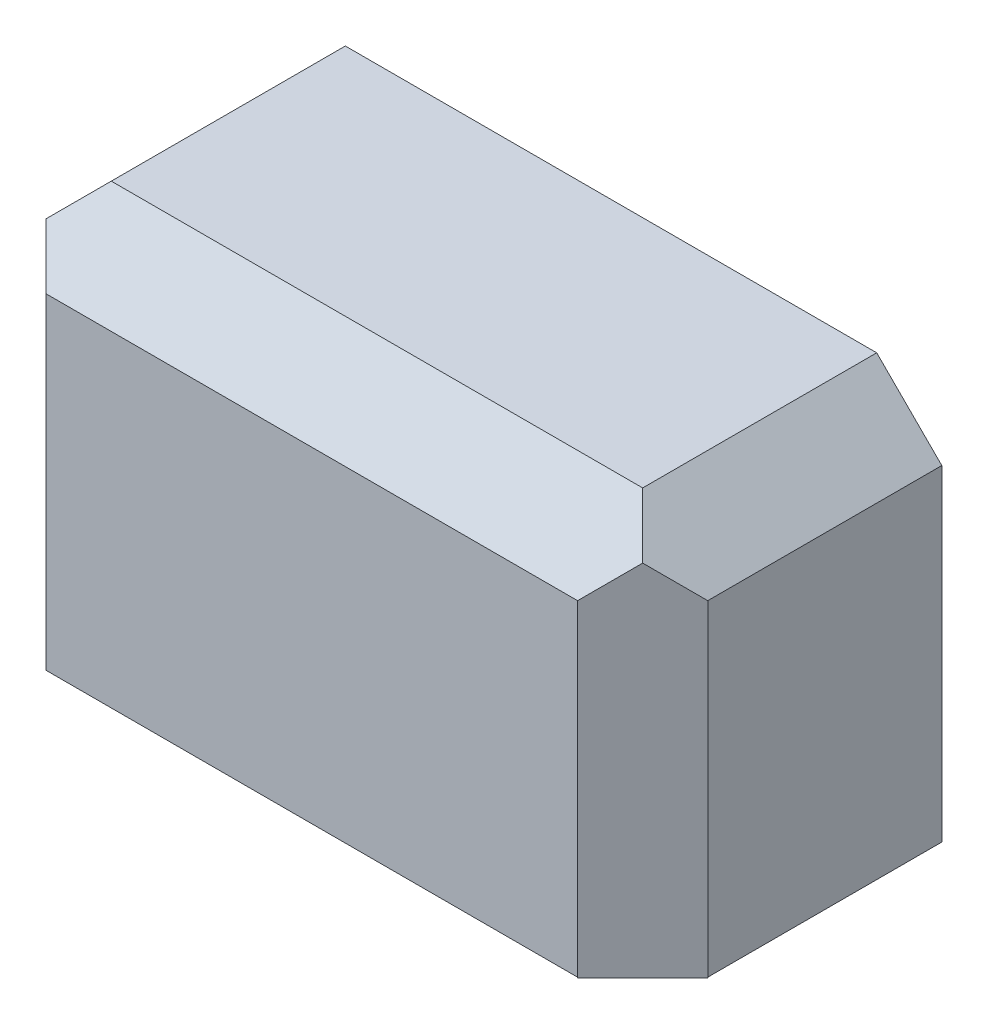
ISO-10303-21;
HEADER;
FILE_DESCRIPTION(('STEP AP214'),'2;1');
FILE_NAME('part.step','',(''),(''),'','','');
FILE_SCHEMA(('AUTOMOTIVE_DESIGN { 1 0 10303 214 1 1 1 1 }'));
ENDSEC;
DATA;
#1=APPLICATION_CONTEXT('core data for automotive mechanical design processes');
#2=APPLICATION_PROTOCOL_DEFINITION('international standard','automotive_design',2000,#1);
#3=PRODUCT_CONTEXT('',#1,'mechanical');
#4=PRODUCT('Part','Part','',(#3));
#5=PRODUCT_RELATED_PRODUCT_CATEGORY('part','',(#4));
#6=PRODUCT_DEFINITION_FORMATION('','',#4);
#7=PRODUCT_DEFINITION_CONTEXT('part definition',#1,'design');
#8=PRODUCT_DEFINITION('design','',#6,#7);
#9=PRODUCT_DEFINITION_SHAPE('','',#8);
#10=(LENGTH_UNIT() NAMED_UNIT(*) SI_UNIT(.MILLI.,.METRE.));
#11=(NAMED_UNIT(*) PLANE_ANGLE_UNIT() SI_UNIT($,.RADIAN.));
#12=(NAMED_UNIT(*) SI_UNIT($,.STERADIAN.) SOLID_ANGLE_UNIT());
#13=UNCERTAINTY_MEASURE_WITH_UNIT(LENGTH_MEASURE(1.E-05),#10,'distance_accuracy_value','');
#14=(GEOMETRIC_REPRESENTATION_CONTEXT(3) GLOBAL_UNCERTAINTY_ASSIGNED_CONTEXT((#13)) GLOBAL_UNIT_ASSIGNED_CONTEXT((#10,
#11,#12)) REPRESENTATION_CONTEXT('',''));
#15=CARTESIAN_POINT('',(0.,0.,0.));
#16=DIRECTION('',(0.,0.,1.));
#17=DIRECTION('',(1.,0.,0.));
#18=AXIS2_PLACEMENT_3D('',#15,#16,#17);
#19=CARTESIAN_POINT('',(365.125,0.,165.1));
#20=DIRECTION('',(0.,1.,0.));
#21=DIRECTION('',(-1.,0.,0.));
#22=AXIS2_PLACEMENT_3D('',#19,#20,#21);
#23=PLANE('',#22);
#24=DIRECTION('',(-0.707106781186545,0.,-0.70710678118655));
#25=VECTOR('',#24,1.);
#26=CARTESIAN_POINT('',(383.085512242138,0.,147.139487757862));
#27=LINE('',#26,#25);
#28=CARTESIAN_POINT('',(365.125,0.,129.178975515723));
#29=VERTEX_POINT('',#28);
#30=CARTESIAN_POINT('',(361.757403954599,0.,125.811379470323));
#31=VERTEX_POINT('',#30);
#32=EDGE_CURVE('E47',#29,#31,#27,.T.);
#33=ORIENTED_EDGE('',*,*,#32,.T.);
#34=DIRECTION('',(-0.707106781186548,0.,0.707106781186547));
#35=VECTOR('',#34,1.);
#36=CARTESIAN_POINT('',(343.796891712461,0.,143.771891712461));
#37=LINE('',#36,#35);
#38=CARTESIAN_POINT('',(360.3625,0.,127.206283424922));
#39=VERTEX_POINT('',#38);
#40=EDGE_CURVE('E362',#31,#39,#37,.T.);
#41=ORIENTED_EDGE('',*,*,#40,.T.);
#42=DIRECTION('',(0.,0.,1.));
#43=VECTOR('',#42,1.);
#44=CARTESIAN_POINT('',(360.3625,0.,4.7625));
#45=LINE('',#44,#43);
#46=CARTESIAN_POINT('',(360.3625,0.,4.7625));
#47=VERTEX_POINT('',#46);
#48=EDGE_CURVE('E247',#47,#39,#45,.T.);
#49=ORIENTED_EDGE('',*,*,#48,.F.);
#50=DIRECTION('',(1.,0.,0.));
#51=VECTOR('',#50,1.);
#52=CARTESIAN_POINT('',(4.7625,0.,4.7625));
#53=LINE('',#52,#51);
#54=CARTESIAN_POINT('',(4.7625,0.,4.7625));
#55=VERTEX_POINT('',#54);
#56=EDGE_CURVE('E223',#55,#47,#53,.T.);
#57=ORIENTED_EDGE('',*,*,#56,.F.);
#58=DIRECTION('',(0.,0.,1.));
#59=VECTOR('',#58,1.);
#60=CARTESIAN_POINT('',(4.7625,0.,4.7625));
#61=LINE('',#60,#59);
#62=CARTESIAN_POINT('',(4.7625,0.,127.206283424922));
#63=VERTEX_POINT('',#62);
#64=EDGE_CURVE('E248',#55,#63,#61,.T.);
#65=ORIENTED_EDGE('',*,*,#64,.T.);
#66=DIRECTION('',(0.707106781186549,0.,0.707106781186546));
#67=VECTOR('',#66,1.);
#68=CARTESIAN_POINT('',(203.89060828754,0.,326.334391712461));
#69=LINE('',#68,#67);
#70=CARTESIAN_POINT('',(3.36759604540092,0.,125.811379470323));
#71=VERTEX_POINT('',#70);
#72=EDGE_CURVE('E324',#71,#63,#69,.T.);
#73=ORIENTED_EDGE('',*,*,#72,.F.);
#74=DIRECTION('',(0.707106781186546,0.,-0.707106781186549));
#75=VECTOR('',#74,1.);
#76=CARTESIAN_POINT('',(164.601987757861,0.,-35.4230122421382));
#77=LINE('',#76,#75);
#78=CARTESIAN_POINT('',(0.,0.,129.178975515723));
#79=VERTEX_POINT('',#78);
#80=EDGE_CURVE('E334',#79,#71,#77,.T.);
#81=ORIENTED_EDGE('',*,*,#80,.F.);
#82=DIRECTION('',(0.,0.,-1.));
#83=VECTOR('',#82,1.);
#84=CARTESIAN_POINT('',(0.,0.,165.1));
#85=LINE('',#84,#83);
#86=CARTESIAN_POINT('',(0.,0.,0.));
#87=VERTEX_POINT('',#86);
#88=EDGE_CURVE('E267',#79,#87,#85,.T.);
#89=ORIENTED_EDGE('',*,*,#88,.T.);
#90=DIRECTION('',(1.,0.,0.));
#91=VECTOR('',#90,1.);
#92=CARTESIAN_POINT('',(365.125,0.,0.));
#93=LINE('',#92,#91);
#94=CARTESIAN_POINT('',(365.125,0.,0.));
#95=VERTEX_POINT('',#94);
#96=EDGE_CURVE('E251',#87,#95,#93,.T.);
#97=ORIENTED_EDGE('',*,*,#96,.T.);
#98=DIRECTION('',(0.,0.,-1.));
#99=VECTOR('',#98,1.);
#100=CARTESIAN_POINT('',(365.125,0.,165.1));
#101=LINE('',#100,#99);
#102=EDGE_CURVE('E294',#29,#95,#101,.T.);
#103=ORIENTED_EDGE('',*,*,#102,.F.);
#104=EDGE_LOOP('',(#33,#41,#49,#57,#65,#73,#81,#89,#97,#103));
#105=FACE_BOUND('',#104,.T.);
#106=ADVANCED_FACE('F32',(#105),#23,.F.);
#107=CARTESIAN_POINT('',(0.,179.978975515723,165.1));
#108=DIRECTION('',(0.707106781186547,-0.707106781186548,0.));
#109=DIRECTION('',(0.707106781186548,0.707106781186547,0.));
#110=AXIS2_PLACEMENT_3D('',#107,#108,#109);
#111=PLANE('',#110);
#112=DIRECTION('',(0.,0.,-1.));
#113=VECTOR('',#112,1.);
#114=CARTESIAN_POINT('',(0.,179.978975515723,165.1));
#115=LINE('',#114,#113);
#116=CARTESIAN_POINT('',(0.,179.978975515723,129.178975515724));
#117=VERTEX_POINT('',#116);
#118=CARTESIAN_POINT('',(0.,179.978975515723,0.));
#119=VERTEX_POINT('',#118);
#120=EDGE_CURVE('E286',#117,#119,#115,.T.);
#121=ORIENTED_EDGE('',*,*,#120,.F.);
#122=DIRECTION('',(-0.577350269189627,-0.577350269189626,-0.577350269189625));
#123=VECTOR('',#122,1.);
#124=CARTESIAN_POINT('',(-109.734658505241,70.2443170104821,19.4443170104825));
#125=LINE('',#124,#123);
#126=CARTESIAN_POINT('',(17.9605122421383,197.939487757862,147.139487757862));
#127=VERTEX_POINT('',#126);
#128=EDGE_CURVE('E213',#127,#117,#125,.T.);
#129=ORIENTED_EDGE('',*,*,#128,.F.);
#130=DIRECTION('',(0.577350269189627,0.577350269189626,-0.577350269189624));
#131=VECTOR('',#130,1.);
#132=CARTESIAN_POINT('',(125.433666666667,305.41264218239,39.6663333333334));
#133=LINE('',#132,#131);
#134=CARTESIAN_POINT('',(35.9210244842766,215.9,129.178975515723));
#135=VERTEX_POINT('',#134);
#136=EDGE_CURVE('E319',#127,#135,#133,.T.);
#137=ORIENTED_EDGE('',*,*,#136,.T.);
#138=DIRECTION('',(0.,0.,-1.));
#139=VECTOR('',#138,1.);
#140=CARTESIAN_POINT('',(35.9210244842766,215.9,165.1));
#141=LINE('',#140,#139);
#142=CARTESIAN_POINT('',(35.9210244842766,215.9,0.));
#143=VERTEX_POINT('',#142);
#144=EDGE_CURVE('E288',#135,#143,#141,.T.);
#145=ORIENTED_EDGE('',*,*,#144,.T.);
#146=DIRECTION('',(-0.707106781186548,-0.707106781186547,0.));
#147=VECTOR('',#146,1.);
#148=CARTESIAN_POINT('',(0.,179.978975515723,0.));
#149=LINE('',#148,#147);
#150=EDGE_CURVE('E280',#143,#119,#149,.T.);
#151=ORIENTED_EDGE('',*,*,#150,.T.);
#152=EDGE_LOOP('',(#121,#129,#137,#145,#151));
#153=FACE_BOUND('',#152,.T.);
#154=ADVANCED_FACE('F433',(#153),#111,.F.);
#155=CARTESIAN_POINT('',(4.7625,177.794773237157,4.7625));
#156=DIRECTION('',(-0.707106781186548,0.707106781186548,0.));
#157=DIRECTION('',(-0.707106781186548,-0.707106781186548,0.));
#158=AXIS2_PLACEMENT_3D('',#155,#156,#157);
#159=PLANE('',#158);
#160=DIRECTION('',(0.577350269189627,0.577350269189627,0.577350269189624));
#161=VECTOR('',#160,1.);
#162=CARTESIAN_POINT('',(-36.0520944749738,136.980178762183,86.3916889499479));
#163=LINE('',#162,#161);
#164=CARTESIAN_POINT('',(4.7625,177.794773237157,127.206283424922));
#165=VERTEX_POINT('',#164);
#166=CARTESIAN_POINT('',(21.4338633814217,194.466136618578,143.877646806343));
#167=VERTEX_POINT('',#166);
#168=EDGE_CURVE('E309',#165,#167,#163,.T.);
#169=ORIENTED_EDGE('',*,*,#168,.F.);
#170=DIRECTION('',(0.,0.,1.));
#171=VECTOR('',#170,1.);
#172=CARTESIAN_POINT('',(4.7625,177.794773237157,4.7625));
#173=LINE('',#172,#171);
#174=CARTESIAN_POINT('',(4.7625,177.794773237157,4.7625));
#175=VERTEX_POINT('',#174);
#176=EDGE_CURVE('E252',#175,#165,#173,.T.);
#177=ORIENTED_EDGE('',*,*,#176,.F.);
#178=DIRECTION('',(-0.707106781186547,-0.707106781186547,0.));
#179=VECTOR('',#178,1.);
#180=CARTESIAN_POINT('',(4.7625,177.794773237157,4.7625));
#181=LINE('',#180,#179);
#182=CARTESIAN_POINT('',(38.1052267628434,211.1375,4.7625));
#183=VERTEX_POINT('',#182);
#184=EDGE_CURVE('E241',#183,#175,#181,.T.);
#185=ORIENTED_EDGE('',*,*,#184,.F.);
#186=DIRECTION('',(0.,0.,1.));
#187=VECTOR('',#186,1.);
#188=CARTESIAN_POINT('',(38.1052267628434,211.1375,4.7625));
#189=LINE('',#188,#187);
#190=CARTESIAN_POINT('',(38.1052267628434,211.1375,127.206283424922));
#191=VERTEX_POINT('',#190);
#192=EDGE_CURVE('E255',#183,#191,#189,.T.);
#193=ORIENTED_EDGE('',*,*,#192,.T.);
#194=DIRECTION('',(-0.577350269189626,-0.577350269189626,0.577350269189625));
#195=VECTOR('',#194,1.);
#196=CARTESIAN_POINT('',(56.6913367292549,229.723609966411,108.62017345851));
#197=LINE('',#196,#195);
#198=EDGE_CURVE('E226',#191,#167,#197,.T.);
#199=ORIENTED_EDGE('',*,*,#198,.T.);
#200=EDGE_LOOP('',(#169,#177,#185,#193,#199));
#201=FACE_BOUND('',#200,.T.);
#202=ADVANCED_FACE('F308',(#201),#159,.F.);
#203=CARTESIAN_POINT('',(0.,0.,160.3375));
#204=DIRECTION('',(0.,0.,-1.));
#205=DIRECTION('',(-1.,0.,0.));
#206=AXIS2_PLACEMENT_3D('',#203,#204,#205);
#207=PLANE('',#206);
#208=DIRECTION('',(0.,1.,0.));
#209=VECTOR('',#208,1.);
#210=CARTESIAN_POINT('',(327.231283424922,0.,160.3375));
#211=LINE('',#210,#209);
#212=CARTESIAN_POINT('',(327.231283424922,0.,160.3375));
#213=VERTEX_POINT('',#212);
#214=CARTESIAN_POINT('',(327.231283424921,178.006283424921,160.3375));
#215=VERTEX_POINT('',#214);
#216=EDGE_CURVE('E364',#213,#215,#211,.T.);
#217=ORIENTED_EDGE('',*,*,#216,.F.);
#218=DIRECTION('',(1.,0.,0.));
#219=VECTOR('',#218,1.);
#220=CARTESIAN_POINT('',(365.125,0.,160.3375));
#221=LINE('',#220,#219);
#222=CARTESIAN_POINT('',(37.8937165750785,0.,160.3375));
#223=VERTEX_POINT('',#222);
#224=EDGE_CURVE('E220',#223,#213,#221,.T.);
#225=ORIENTED_EDGE('',*,*,#224,.F.);
#226=DIRECTION('',(0.,1.,0.));
#227=VECTOR('',#226,1.);
#228=CARTESIAN_POINT('',(37.8937165750785,0.,160.3375));
#229=LINE('',#228,#227);
#230=CARTESIAN_POINT('',(37.8937165750785,178.006283424921,160.3375));
#231=VERTEX_POINT('',#230);
#232=EDGE_CURVE('E332',#223,#231,#229,.T.);
#233=ORIENTED_EDGE('',*,*,#232,.T.);
#234=DIRECTION('',(-1.,0.,0.));
#235=VECTOR('',#234,1.);
#236=CARTESIAN_POINT('',(0.,178.006283424921,160.3375));
#237=LINE('',#236,#235);
#238=EDGE_CURVE('E303',#215,#231,#237,.T.);
#239=ORIENTED_EDGE('',*,*,#238,.F.);
#240=EDGE_LOOP('',(#217,#225,#233,#239));
#241=FACE_BOUND('',#240,.T.);
#242=ADVANCED_FACE('F450',(#241),#207,.T.);
#243=DIRECTION('',(-0.707106781186548,0.,0.707106781186547));
#244=VECTOR('',#243,1.);
#245=CARTESIAN_POINT('',(343.796891712461,0.,143.771891712461));
#246=LINE('',#245,#244);
#247=CARTESIAN_POINT('',(325.836379470322,0.,161.732403954599));
#248=VERTEX_POINT('',#247);
#249=EDGE_CURVE('E55',#213,#248,#246,.T.);
#250=ORIENTED_EDGE('',*,*,#249,.T.);
#251=DIRECTION('',(0.707106781186545,0.,0.70710678118655));
#252=VECTOR('',#251,1.);
#253=CARTESIAN_POINT('',(347.164487757862,0.,183.060512242138));
#254=LINE('',#253,#252);
#255=CARTESIAN_POINT('',(329.203975515723,0.,165.1));
#256=VERTEX_POINT('',#255);
#257=EDGE_CURVE('E372',#248,#256,#254,.T.);
#258=ORIENTED_EDGE('',*,*,#257,.T.);
#259=DIRECTION('',(1.,0.,0.));
#260=VECTOR('',#259,1.);
#261=CARTESIAN_POINT('',(365.125,0.,165.1));
#262=LINE('',#261,#260);
#263=CARTESIAN_POINT('',(35.9210244842766,0.,165.1));
#264=VERTEX_POINT('',#263);
#265=EDGE_CURVE('E211',#264,#256,#262,.T.);
#266=ORIENTED_EDGE('',*,*,#265,.F.);
#267=DIRECTION('',(-0.707106781186546,0.,0.707106781186549));
#268=VECTOR('',#267,1.);
#269=CARTESIAN_POINT('',(200.523012242138,0.,0.498012242138329));
#270=LINE('',#269,#268);
#271=CARTESIAN_POINT('',(39.2886205296776,0.,161.732403954599));
#272=VERTEX_POINT('',#271);
#273=EDGE_CURVE('E336',#272,#264,#270,.T.);
#274=ORIENTED_EDGE('',*,*,#273,.F.);
#275=EDGE_CURVE('E327',#223,#272,#69,.T.);
#276=ORIENTED_EDGE('',*,*,#275,.F.);
#277=ORIENTED_EDGE('',*,*,#224,.T.);
#278=EDGE_LOOP('',(#250,#258,#266,#274,#276,#277));
#279=FACE_BOUND('',#278,.T.);
#280=ADVANCED_FACE('F34',(#279),#23,.F.);
#281=CARTESIAN_POINT('',(4.7625,0.,4.7625));
#282=DIRECTION('',(-1.,0.,0.));
#283=DIRECTION('',(0.,-1.,0.));
#284=AXIS2_PLACEMENT_3D('',#281,#282,#283);
#285=PLANE('',#284);
#286=DIRECTION('',(0.,1.,0.));
#287=VECTOR('',#286,1.);
#288=CARTESIAN_POINT('',(4.7625,0.,127.206283424922));
#289=LINE('',#288,#287);
#290=EDGE_CURVE('E329',#63,#165,#289,.T.);
#291=ORIENTED_EDGE('',*,*,#290,.F.);
#292=ORIENTED_EDGE('',*,*,#64,.F.);
#293=DIRECTION('',(0.,-1.,0.));
#294=VECTOR('',#293,1.);
#295=CARTESIAN_POINT('',(4.7625,0.,4.7625));
#296=LINE('',#295,#294);
#297=EDGE_CURVE('E244',#175,#55,#296,.T.);
#298=ORIENTED_EDGE('',*,*,#297,.F.);
#299=ORIENTED_EDGE('',*,*,#176,.T.);
#300=EDGE_LOOP('',(#291,#292,#298,#299));
#301=FACE_BOUND('',#300,.T.);
#302=ADVANCED_FACE('F469',(#301),#285,.F.);
#303=CARTESIAN_POINT('',(376.301,179.978975515723,165.1));
#304=DIRECTION('',(0.,0.707106781186546,0.707106781186549));
#305=DIRECTION('',(0.,-0.707106781186549,0.707106781186546));
#306=AXIS2_PLACEMENT_3D('',#303,#304,#305);
#307=PLANE('',#306);
#308=DIRECTION('',(-1.,0.,0.));
#309=VECTOR('',#308,1.);
#310=CARTESIAN_POINT('',(376.301,179.978975515723,165.1));
#311=LINE('',#310,#309);
#312=CARTESIAN_POINT('',(329.203975515723,179.978975515723,165.1));
#313=VERTEX_POINT('',#312);
#314=CARTESIAN_POINT('',(35.9210244842766,179.978975515723,165.1));
#315=VERTEX_POINT('',#314);
#316=EDGE_CURVE('E208',#313,#315,#311,.T.);
#317=ORIENTED_EDGE('',*,*,#316,.F.);
#318=DIRECTION('',(-0.577350269189626,-0.577350269189627,0.577350269189625));
#319=VECTOR('',#318,1.);
#320=CARTESIAN_POINT('',(269.083983677149,119.858983677149,225.219991838574));
#321=LINE('',#320,#319);
#322=CARTESIAN_POINT('',(347.164487757862,197.939487757862,147.139487757862));
#323=VERTEX_POINT('',#322);
#324=EDGE_CURVE('E195',#323,#313,#321,.T.);
#325=ORIENTED_EDGE('',*,*,#324,.F.);
#326=DIRECTION('',(0.577350269189626,-0.577350269189627,0.577350269189625));
#327=VECTOR('',#326,1.);
#328=CARTESIAN_POINT('',(368.850333333333,176.25364218239,168.825333333333));
#329=LINE('',#328,#327);
#330=CARTESIAN_POINT('',(329.203975515723,215.9,129.178975515723));
#331=VERTEX_POINT('',#330);
#332=EDGE_CURVE('E317',#331,#323,#329,.T.);
#333=ORIENTED_EDGE('',*,*,#332,.F.);
#334=DIRECTION('',(-1.,0.,0.));
#335=VECTOR('',#334,1.);
#336=CARTESIAN_POINT('',(376.301,215.9,129.178975515723));
#337=LINE('',#336,#335);
#338=EDGE_CURVE('E221',#331,#135,#337,.T.);
#339=ORIENTED_EDGE('',*,*,#338,.T.);
#340=ORIENTED_EDGE('',*,*,#136,.F.);
#341=DIRECTION('',(-0.577350269189627,0.577350269189626,-0.577350269189625));
#342=VECTOR('',#341,1.);
#343=CARTESIAN_POINT('',(121.708333333334,94.1916666666666,250.887308849057));
#344=LINE('',#343,#342);
#345=EDGE_CURVE('E218',#315,#127,#344,.T.);
#346=ORIENTED_EDGE('',*,*,#345,.F.);
#347=EDGE_LOOP('',(#317,#325,#333,#339,#340,#346));
#348=FACE_BOUND('',#347,.T.);
#349=ADVANCED_FACE('F216',(#348),#307,.T.);
#350=CARTESIAN_POINT('',(0.,212.532403954599,125.811379470323));
#351=DIRECTION('',(0.,-0.707106781186546,-0.707106781186549));
#352=DIRECTION('',(0.,0.707106781186549,-0.707106781186546));
#353=AXIS2_PLACEMENT_3D('',#350,#351,#352);
#354=PLANE('',#353);
#355=DIRECTION('',(0.577350269189626,0.577350269189627,-0.577350269189625));
#356=VECTOR('',#355,1.);
#357=CARTESIAN_POINT('',(241.171602636399,91.9466026363992,246.397180788522));
#358=LINE('',#357,#356);
#359=CARTESIAN_POINT('',(343.796891712461,194.571891712461,143.771891712461));
#360=VERTEX_POINT('',#359);
#361=EDGE_CURVE('E367',#215,#360,#358,.T.);
#362=ORIENTED_EDGE('',*,*,#361,.F.);
#363=ORIENTED_EDGE('',*,*,#238,.T.);
#364=DIRECTION('',(-0.577350269189627,0.577350269189626,-0.577350269189624));
#365=VECTOR('',#364,1.);
#366=CARTESIAN_POINT('',(2.24506403026728,213.654935969733,124.688847455189));
#367=LINE('',#366,#365);
#368=EDGE_CURVE('E40',#231,#167,#367,.T.);
#369=ORIENTED_EDGE('',*,*,#368,.T.);
#370=ORIENTED_EDGE('',*,*,#198,.F.);
#371=DIRECTION('',(-1.,0.,0.));
#372=VECTOR('',#371,1.);
#373=CARTESIAN_POINT('',(38.1052267628434,211.1375,127.206283424922));
#374=LINE('',#373,#372);
#375=CARTESIAN_POINT('',(327.231283424922,211.1375,127.206283424922));
#376=VERTEX_POINT('',#375);
#377=EDGE_CURVE('E311',#376,#191,#374,.T.);
#378=ORIENTED_EDGE('',*,*,#377,.F.);
#379=DIRECTION('',(-0.577350269189626,0.577350269189626,-0.577350269189625));
#380=VECTOR('',#379,1.);
#381=CARTESIAN_POINT('',(286.416688949948,251.952094474974,86.3916889499479));
#382=LINE('',#381,#380);
#383=EDGE_CURVE('E312',#360,#376,#382,.T.);
#384=ORIENTED_EDGE('',*,*,#383,.F.);
#385=EDGE_LOOP('',(#362,#363,#369,#370,#378,#384));
#386=FACE_BOUND('',#385,.T.);
#387=ADVANCED_FACE('F300',(#386),#354,.T.);
#388=CARTESIAN_POINT('',(329.203975515723,215.9,165.1));
#389=DIRECTION('',(-0.707106781186548,-0.707106781186547,0.));
#390=DIRECTION('',(0.707106781186547,-0.707106781186548,0.));
#391=AXIS2_PLACEMENT_3D('',#388,#389,#390);
#392=PLANE('',#391);
#393=ORIENTED_EDGE('',*,*,#332,.T.);
#394=DIRECTION('',(-0.577350269189626,0.577350269189627,0.577350269189625));
#395=VECTOR('',#394,1.);
#396=CARTESIAN_POINT('',(401.29764218239,143.806333333333,93.0063333333335));
#397=LINE('',#396,#395);
#398=CARTESIAN_POINT('',(365.125,179.978975515723,129.178975515723));
#399=VERTEX_POINT('',#398);
#400=EDGE_CURVE('E201',#399,#323,#397,.T.);
#401=ORIENTED_EDGE('',*,*,#400,.F.);
#402=DIRECTION('',(0.,0.,-1.));
#403=VECTOR('',#402,1.);
#404=CARTESIAN_POINT('',(365.125,179.978975515723,165.1));
#405=LINE('',#404,#403);
#406=CARTESIAN_POINT('',(365.125,179.978975515723,0.));
#407=VERTEX_POINT('',#406);
#408=EDGE_CURVE('E292',#399,#407,#405,.T.);
#409=ORIENTED_EDGE('',*,*,#408,.T.);
#410=DIRECTION('',(-0.707106781186547,0.707106781186548,0.));
#411=VECTOR('',#410,1.);
#412=CARTESIAN_POINT('',(329.203975515723,215.9,0.));
#413=LINE('',#412,#411);
#414=CARTESIAN_POINT('',(329.203975515723,215.9,0.));
#415=VERTEX_POINT('',#414);
#416=EDGE_CURVE('E274',#407,#415,#413,.T.);
#417=ORIENTED_EDGE('',*,*,#416,.T.);
#418=DIRECTION('',(0.,0.,-1.));
#419=VECTOR('',#418,1.);
#420=CARTESIAN_POINT('',(329.203975515723,215.9,165.1));
#421=LINE('',#420,#419);
#422=EDGE_CURVE('E290',#331,#415,#421,.T.);
#423=ORIENTED_EDGE('',*,*,#422,.F.);
#424=EDGE_LOOP('',(#393,#401,#409,#417,#423));
#425=FACE_BOUND('',#424,.T.);
#426=ADVANCED_FACE('F426',(#425),#392,.F.);
#427=CARTESIAN_POINT('',(35.9210244842766,215.9,165.1));
#428=DIRECTION('',(0.,-1.,0.));
#429=DIRECTION('',(0.,0.,-1.));
#430=AXIS2_PLACEMENT_3D('',#427,#428,#429);
#431=PLANE('',#430);
#432=DIRECTION('',(-1.,0.,0.));
#433=VECTOR('',#432,1.);
#434=CARTESIAN_POINT('',(35.9210244842766,215.9,0.));
#435=LINE('',#434,#433);
#436=EDGE_CURVE('E277',#415,#143,#435,.T.);
#437=ORIENTED_EDGE('',*,*,#436,.T.);
#438=ORIENTED_EDGE('',*,*,#144,.F.);
#439=ORIENTED_EDGE('',*,*,#338,.F.);
#440=ORIENTED_EDGE('',*,*,#422,.T.);
#441=EDGE_LOOP('',(#437,#438,#439,#440));
#442=FACE_BOUND('',#441,.T.);
#443=ADVANCED_FACE('F430',(#442),#431,.F.);
#444=CARTESIAN_POINT('',(0.,0.,165.1));
#445=DIRECTION('',(0.,0.,-1.));
#446=DIRECTION('',(-1.,0.,0.));
#447=AXIS2_PLACEMENT_3D('',#444,#445,#446);
#448=PLANE('',#447);
#449=ORIENTED_EDGE('',*,*,#265,.T.);
#450=DIRECTION('',(0.,1.,0.));
#451=VECTOR('',#450,1.);
#452=CARTESIAN_POINT('',(329.203975515723,-0.380999999999465,165.1));
#453=LINE('',#452,#451);
#454=EDGE_CURVE('E198',#256,#313,#453,.T.);
#455=ORIENTED_EDGE('',*,*,#454,.T.);
#456=ORIENTED_EDGE('',*,*,#316,.T.);
#457=DIRECTION('',(0.,1.,0.));
#458=VECTOR('',#457,1.);
#459=CARTESIAN_POINT('',(35.9210244842766,-149.225,165.1));
#460=LINE('',#459,#458);
#461=EDGE_CURVE('E322',#264,#315,#460,.T.);
#462=ORIENTED_EDGE('',*,*,#461,.F.);
#463=EDGE_LOOP('',(#449,#455,#456,#462));
#464=FACE_BOUND('',#463,.T.);
#465=ADVANCED_FACE('F206',(#464),#448,.F.);
#466=CARTESIAN_POINT('',(38.1052267628434,211.1375,4.7625));
#467=DIRECTION('',(0.,1.,0.));
#468=DIRECTION('',(0.,0.,1.));
#469=AXIS2_PLACEMENT_3D('',#466,#467,#468);
#470=PLANE('',#469);
#471=DIRECTION('',(0.,0.,1.));
#472=VECTOR('',#471,1.);
#473=CARTESIAN_POINT('',(327.231283424922,211.1375,4.7625));
#474=LINE('',#473,#472);
#475=CARTESIAN_POINT('',(327.231283424922,211.1375,4.7625));
#476=VERTEX_POINT('',#475);
#477=EDGE_CURVE('E258',#476,#376,#474,.T.);
#478=ORIENTED_EDGE('',*,*,#477,.T.);
#479=ORIENTED_EDGE('',*,*,#377,.T.);
#480=ORIENTED_EDGE('',*,*,#192,.F.);
#481=DIRECTION('',(-1.,0.,0.));
#482=VECTOR('',#481,1.);
#483=CARTESIAN_POINT('',(38.1052267628434,211.1375,4.7625));
#484=LINE('',#483,#482);
#485=EDGE_CURVE('E238',#476,#183,#484,.T.);
#486=ORIENTED_EDGE('',*,*,#485,.F.);
#487=EDGE_LOOP('',(#478,#479,#480,#486));
#488=FACE_BOUND('',#487,.T.);
#489=ADVANCED_FACE('F458',(#488),#470,.F.);
#490=CARTESIAN_POINT('',(327.231283424922,211.1375,4.7625));
#491=DIRECTION('',(0.707106781186548,0.707106781186548,0.));
#492=DIRECTION('',(-0.707106781186548,0.707106781186548,0.));
#493=AXIS2_PLACEMENT_3D('',#490,#491,#492);
#494=PLANE('',#493);
#495=DIRECTION('',(0.,0.,1.));
#496=VECTOR('',#495,1.);
#497=CARTESIAN_POINT('',(360.3625,178.006283424921,4.7625));
#498=LINE('',#497,#496);
#499=CARTESIAN_POINT('',(360.3625,178.006283424921,4.7625));
#500=VERTEX_POINT('',#499);
#501=CARTESIAN_POINT('',(360.3625,178.006283424921,127.206283424922));
#502=VERTEX_POINT('',#501);
#503=EDGE_CURVE('E261',#500,#502,#498,.T.);
#504=ORIENTED_EDGE('',*,*,#503,.T.);
#505=DIRECTION('',(-0.577350269189626,0.577350269189626,0.577350269189625));
#506=VECTOR('',#505,1.);
#507=CARTESIAN_POINT('',(379.089616758255,159.279166666667,108.479166666667));
#508=LINE('',#507,#506);
#509=EDGE_CURVE('E370',#502,#360,#508,.T.);
#510=ORIENTED_EDGE('',*,*,#509,.T.);
#511=ORIENTED_EDGE('',*,*,#383,.T.);
#512=ORIENTED_EDGE('',*,*,#477,.F.);
#513=DIRECTION('',(-0.707106781186547,0.707106781186547,0.));
#514=VECTOR('',#513,1.);
#515=CARTESIAN_POINT('',(327.231283424922,211.1375,4.7625));
#516=LINE('',#515,#514);
#517=EDGE_CURVE('E235',#500,#476,#516,.T.);
#518=ORIENTED_EDGE('',*,*,#517,.F.);
#519=EDGE_LOOP('',(#504,#510,#511,#512,#518));
#520=FACE_BOUND('',#519,.T.);
#521=ADVANCED_FACE('F454',(#520),#494,.F.);
#522=CARTESIAN_POINT('',(365.125,179.978975515723,165.1));
#523=DIRECTION('',(-1.,0.,0.));
#524=DIRECTION('',(0.,0.,1.));
#525=AXIS2_PLACEMENT_3D('',#522,#523,#524);
#526=PLANE('',#525);
#527=ORIENTED_EDGE('',*,*,#408,.F.);
#528=DIRECTION('',(0.,1.,0.));
#529=VECTOR('',#528,1.);
#530=CARTESIAN_POINT('',(365.125,-0.380999999999465,129.178975515723));
#531=LINE('',#530,#529);
#532=EDGE_CURVE('E214',#29,#399,#531,.T.);
#533=ORIENTED_EDGE('',*,*,#532,.F.);
#534=ORIENTED_EDGE('',*,*,#102,.T.);
#535=DIRECTION('',(0.,1.,0.));
#536=VECTOR('',#535,1.);
#537=CARTESIAN_POINT('',(365.125,179.978975515723,0.));
#538=LINE('',#537,#536);
#539=EDGE_CURVE('E271',#95,#407,#538,.T.);
#540=ORIENTED_EDGE('',*,*,#539,.T.);
#541=EDGE_LOOP('',(#527,#533,#534,#540));
#542=FACE_BOUND('',#541,.T.);
#543=ADVANCED_FACE('F413',(#542),#526,.F.);
#544=CARTESIAN_POINT('',(0.,0.,165.1));
#545=DIRECTION('',(1.,0.,0.));
#546=DIRECTION('',(0.,0.,-1.));
#547=AXIS2_PLACEMENT_3D('',#544,#545,#546);
#548=PLANE('',#547);
#549=ORIENTED_EDGE('',*,*,#88,.F.);
#550=DIRECTION('',(0.,1.,0.));
#551=VECTOR('',#550,1.);
#552=CARTESIAN_POINT('',(0.,-149.225,129.178975515723));
#553=LINE('',#552,#551);
#554=EDGE_CURVE('E321',#79,#117,#553,.T.);
#555=ORIENTED_EDGE('',*,*,#554,.T.);
#556=ORIENTED_EDGE('',*,*,#120,.T.);
#557=DIRECTION('',(0.,-1.,0.));
#558=VECTOR('',#557,1.);
#559=CARTESIAN_POINT('',(0.,0.,0.));
#560=LINE('',#559,#558);
#561=EDGE_CURVE('E268',#119,#87,#560,.T.);
#562=ORIENTED_EDGE('',*,*,#561,.T.);
#563=EDGE_LOOP('',(#549,#555,#556,#562));
#564=FACE_BOUND('',#563,.T.);
#565=ADVANCED_FACE('F473',(#564),#548,.F.);
#566=CARTESIAN_POINT('',(0.,0.,0.));
#567=DIRECTION('',(0.,0.,-1.));
#568=DIRECTION('',(-1.,0.,0.));
#569=AXIS2_PLACEMENT_3D('',#566,#567,#568);
#570=PLANE('',#569);
#571=ORIENTED_EDGE('',*,*,#96,.F.);
#572=ORIENTED_EDGE('',*,*,#561,.F.);
#573=ORIENTED_EDGE('',*,*,#150,.F.);
#574=ORIENTED_EDGE('',*,*,#436,.F.);
#575=ORIENTED_EDGE('',*,*,#416,.F.);
#576=ORIENTED_EDGE('',*,*,#539,.F.);
#577=EDGE_LOOP('',(#571,#572,#573,#574,#575,#576));
#578=FACE_BOUND('',#577,.T.);
#579=ADVANCED_FACE('F420',(#578),#570,.T.);
#580=CARTESIAN_POINT('',(360.3625,178.006283424921,4.7625));
#581=DIRECTION('',(1.,0.,0.));
#582=DIRECTION('',(0.,0.,-1.));
#583=AXIS2_PLACEMENT_3D('',#580,#581,#582);
#584=PLANE('',#583);
#585=ORIENTED_EDGE('',*,*,#48,.T.);
#586=DIRECTION('',(0.,1.,0.));
#587=VECTOR('',#586,1.);
#588=CARTESIAN_POINT('',(360.3625,178.006283424921,127.206283424922));
#589=LINE('',#588,#587);
#590=EDGE_CURVE('E11',#39,#502,#589,.T.);
#591=ORIENTED_EDGE('',*,*,#590,.T.);
#592=ORIENTED_EDGE('',*,*,#503,.F.);
#593=DIRECTION('',(0.,1.,0.));
#594=VECTOR('',#593,1.);
#595=CARTESIAN_POINT('',(360.3625,178.006283424921,4.7625));
#596=LINE('',#595,#594);
#597=EDGE_CURVE('E232',#47,#500,#596,.T.);
#598=ORIENTED_EDGE('',*,*,#597,.F.);
#599=EDGE_LOOP('',(#585,#591,#592,#598));
#600=FACE_BOUND('',#599,.T.);
#601=ADVANCED_FACE('F462',(#600),#584,.F.);
#602=CARTESIAN_POINT('',(0.,0.,4.7625));
#603=DIRECTION('',(0.,0.,-1.));
#604=DIRECTION('',(-1.,0.,0.));
#605=AXIS2_PLACEMENT_3D('',#602,#603,#604);
#606=PLANE('',#605);
#607=ORIENTED_EDGE('',*,*,#56,.T.);
#608=ORIENTED_EDGE('',*,*,#597,.T.);
#609=ORIENTED_EDGE('',*,*,#517,.T.);
#610=ORIENTED_EDGE('',*,*,#485,.T.);
#611=ORIENTED_EDGE('',*,*,#184,.T.);
#612=ORIENTED_EDGE('',*,*,#297,.T.);
#613=EDGE_LOOP('',(#607,#608,#609,#610,#611,#612));
#614=FACE_BOUND('',#613,.T.);
#615=ADVANCED_FACE('F460',(#614),#606,.F.);
#616=CARTESIAN_POINT('',(0.,-149.225,129.178975515723));
#617=DIRECTION('',(0.707106781186546,0.,-0.707106781186549));
#618=DIRECTION('',(-0.707106781186549,0.,-0.707106781186546));
#619=AXIS2_PLACEMENT_3D('',#616,#617,#618);
#620=PLANE('',#619);
#621=ORIENTED_EDGE('',*,*,#345,.T.);
#622=ORIENTED_EDGE('',*,*,#128,.T.);
#623=ORIENTED_EDGE('',*,*,#554,.F.);
#624=DIRECTION('',(0.,-1.,0.));
#625=VECTOR('',#624,1.);
#626=CARTESIAN_POINT('',(0.,217.17,129.178975515723));
#627=LINE('',#626,#625);
#628=CARTESIAN_POINT('',(0.,-0.12700000000071,129.178975515723));
#629=VERTEX_POINT('',#628);
#630=EDGE_CURVE('E338',#79,#629,#627,.T.);
#631=ORIENTED_EDGE('',*,*,#630,.T.);
#632=DIRECTION('',(0.707106781186549,0.,0.707106781186546));
#633=VECTOR('',#632,1.);
#634=CARTESIAN_POINT('',(0.,-0.12700000000071,129.178975515723));
#635=LINE('',#634,#633);
#636=CARTESIAN_POINT('',(35.9210244842766,-0.12700000000071,165.1));
#637=VERTEX_POINT('',#636);
#638=EDGE_CURVE('E352',#629,#637,#635,.T.);
#639=ORIENTED_EDGE('',*,*,#638,.T.);
#640=DIRECTION('',(0.,-1.,0.));
#641=VECTOR('',#640,1.);
#642=CARTESIAN_POINT('',(35.9210244842766,217.17,165.1));
#643=LINE('',#642,#641);
#644=EDGE_CURVE('E340',#264,#637,#643,.T.);
#645=ORIENTED_EDGE('',*,*,#644,.F.);
#646=ORIENTED_EDGE('',*,*,#461,.T.);
#647=EDGE_LOOP('',(#621,#622,#623,#631,#639,#645,#646));
#648=FACE_BOUND('',#647,.T.);
#649=ADVANCED_FACE('F437',(#648),#620,.F.);
#650=CARTESIAN_POINT('',(0.,-0.12700000000071,0.));
#651=DIRECTION('',(0.,-1.,0.));
#652=DIRECTION('',(0.,0.,-1.));
#653=AXIS2_PLACEMENT_3D('',#650,#651,#652);
#654=PLANE('',#653);
#655=DIRECTION('',(-0.707106781186546,0.,0.707106781186549));
#656=VECTOR('',#655,1.);
#657=CARTESIAN_POINT('',(0.,-0.12700000000071,129.178975515723));
#658=LINE('',#657,#656);
#659=CARTESIAN_POINT('',(3.36759604540092,-0.12700000000071,125.811379470323));
#660=VERTEX_POINT('',#659);
#661=EDGE_CURVE('E355',#660,#629,#658,.T.);
#662=ORIENTED_EDGE('',*,*,#661,.F.);
#663=DIRECTION('',(-0.707106781186549,0.,-0.707106781186546));
#664=VECTOR('',#663,1.);
#665=CARTESIAN_POINT('',(3.36759604540092,-0.12700000000071,125.811379470323));
#666=LINE('',#665,#664);
#667=CARTESIAN_POINT('',(39.2886205296776,-0.12700000000071,161.732403954599));
#668=VERTEX_POINT('',#667);
#669=EDGE_CURVE('E346',#668,#660,#666,.T.);
#670=ORIENTED_EDGE('',*,*,#669,.F.);
#671=DIRECTION('',(0.707106781186546,0.,-0.707106781186549));
#672=VECTOR('',#671,1.);
#673=CARTESIAN_POINT('',(35.9210244842766,-0.12700000000071,165.1));
#674=LINE('',#673,#672);
#675=EDGE_CURVE('E349',#637,#668,#674,.T.);
#676=ORIENTED_EDGE('',*,*,#675,.F.);
#677=ORIENTED_EDGE('',*,*,#638,.F.);
#678=EDGE_LOOP('',(#662,#670,#676,#677));
#679=FACE_BOUND('',#678,.T.);
#680=ADVANCED_FACE('F526',(#679),#654,.T.);
#681=CARTESIAN_POINT('',(3.36759604540092,217.17,125.811379470323));
#682=DIRECTION('',(-0.707106781186546,0.,0.707106781186549));
#683=DIRECTION('',(0.707106781186549,0.,0.707106781186546));
#684=AXIS2_PLACEMENT_3D('',#681,#682,#683);
#685=PLANE('',#684);
#686=DIRECTION('',(0.,-1.,0.));
#687=VECTOR('',#686,1.);
#688=CARTESIAN_POINT('',(3.36759604540092,217.17,125.811379470323));
#689=LINE('',#688,#687);
#690=EDGE_CURVE('E344',#71,#660,#689,.T.);
#691=ORIENTED_EDGE('',*,*,#690,.F.);
#692=ORIENTED_EDGE('',*,*,#72,.T.);
#693=ORIENTED_EDGE('',*,*,#290,.T.);
#694=ORIENTED_EDGE('',*,*,#168,.T.);
#695=ORIENTED_EDGE('',*,*,#368,.F.);
#696=ORIENTED_EDGE('',*,*,#232,.F.);
#697=ORIENTED_EDGE('',*,*,#275,.T.);
#698=DIRECTION('',(0.,-1.,0.));
#699=VECTOR('',#698,1.);
#700=CARTESIAN_POINT('',(39.2886205296776,217.17,161.732403954599));
#701=LINE('',#700,#699);
#702=EDGE_CURVE('E342',#272,#668,#701,.T.);
#703=ORIENTED_EDGE('',*,*,#702,.T.);
#704=ORIENTED_EDGE('',*,*,#669,.T.);
#705=EDGE_LOOP('',(#691,#692,#693,#694,#695,#696,#697,#703,#704));
#706=FACE_BOUND('',#705,.T.);
#707=ADVANCED_FACE('F448',(#706),#685,.F.);
#708=CARTESIAN_POINT('',(35.9210244842766,217.17,165.1));
#709=DIRECTION('',(-0.707106781186549,0.,-0.707106781186546));
#710=DIRECTION('',(-0.707106781186546,0.,0.707106781186549));
#711=AXIS2_PLACEMENT_3D('',#708,#709,#710);
#712=PLANE('',#711);
#713=ORIENTED_EDGE('',*,*,#702,.F.);
#714=ORIENTED_EDGE('',*,*,#273,.T.);
#715=ORIENTED_EDGE('',*,*,#644,.T.);
#716=ORIENTED_EDGE('',*,*,#675,.T.);
#717=EDGE_LOOP('',(#713,#714,#715,#716));
#718=FACE_BOUND('',#717,.T.);
#719=ADVANCED_FACE('F444',(#718),#712,.F.);
#720=CARTESIAN_POINT('',(0.,217.17,129.178975515723));
#721=DIRECTION('',(0.707106781186549,0.,0.707106781186546));
#722=DIRECTION('',(0.707106781186546,0.,-0.707106781186549));
#723=AXIS2_PLACEMENT_3D('',#720,#721,#722);
#724=PLANE('',#723);
#725=ORIENTED_EDGE('',*,*,#630,.F.);
#726=ORIENTED_EDGE('',*,*,#80,.T.);
#727=ORIENTED_EDGE('',*,*,#690,.T.);
#728=ORIENTED_EDGE('',*,*,#661,.T.);
#729=EDGE_LOOP('',(#725,#726,#727,#728));
#730=FACE_BOUND('',#729,.T.);
#731=ADVANCED_FACE('F527',(#730),#724,.F.);
#732=CARTESIAN_POINT('',(329.203975515723,-0.380999999999465,165.1));
#733=DIRECTION('',(-0.707106781186547,0.,-0.707106781186548));
#734=DIRECTION('',(-0.707106781186548,0.,0.707106781186547));
#735=AXIS2_PLACEMENT_3D('',#732,#733,#734);
#736=PLANE('',#735);
#737=ORIENTED_EDGE('',*,*,#400,.T.);
#738=ORIENTED_EDGE('',*,*,#324,.T.);
#739=ORIENTED_EDGE('',*,*,#454,.F.);
#740=DIRECTION('',(0.,1.,0.));
#741=VECTOR('',#740,1.);
#742=CARTESIAN_POINT('',(329.203975515723,-0.380999999999465,165.1));
#743=LINE('',#742,#741);
#744=CARTESIAN_POINT('',(329.203975515723,-0.380999999999465,165.1));
#745=VERTEX_POINT('',#744);
#746=EDGE_CURVE('E376',#745,#256,#743,.T.);
#747=ORIENTED_EDGE('',*,*,#746,.F.);
#748=DIRECTION('',(0.707106781186548,0.,-0.707106781186547));
#749=VECTOR('',#748,1.);
#750=CARTESIAN_POINT('',(329.203975515723,-0.380999999999465,165.1));
#751=LINE('',#750,#749);
#752=CARTESIAN_POINT('',(365.125,-0.380999999999465,129.178975515723));
#753=VERTEX_POINT('',#752);
#754=EDGE_CURVE('E392',#745,#753,#751,.T.);
#755=ORIENTED_EDGE('',*,*,#754,.T.);
#756=DIRECTION('',(0.,1.,0.));
#757=VECTOR('',#756,1.);
#758=CARTESIAN_POINT('',(365.125,-0.380999999999465,129.178975515723));
#759=LINE('',#758,#757);
#760=EDGE_CURVE('E378',#753,#29,#759,.T.);
#761=ORIENTED_EDGE('',*,*,#760,.T.);
#762=ORIENTED_EDGE('',*,*,#532,.T.);
#763=EDGE_LOOP('',(#737,#738,#739,#747,#755,#761,#762));
#764=FACE_BOUND('',#763,.T.);
#765=ADVANCED_FACE('F197',(#764),#736,.F.);
#766=CARTESIAN_POINT('',(0.,-0.380999999999465,0.));
#767=DIRECTION('',(0.,-1.,0.));
#768=DIRECTION('',(0.,0.,-1.));
#769=AXIS2_PLACEMENT_3D('',#766,#767,#768);
#770=PLANE('',#769);
#771=DIRECTION('',(0.707106781186545,0.,0.707106781186551));
#772=VECTOR('',#771,1.);
#773=CARTESIAN_POINT('',(329.203975515723,-0.380999999999465,165.1));
#774=LINE('',#773,#772);
#775=CARTESIAN_POINT('',(325.836379470322,-0.380999999999465,161.732403954599));
#776=VERTEX_POINT('',#775);
#777=EDGE_CURVE('E395',#776,#745,#774,.T.);
#778=ORIENTED_EDGE('',*,*,#777,.F.);
#779=DIRECTION('',(-0.707106781186548,0.,0.707106781186547));
#780=VECTOR('',#779,1.);
#781=CARTESIAN_POINT('',(325.836379470322,-0.380999999999465,161.732403954599));
#782=LINE('',#781,#780);
#783=CARTESIAN_POINT('',(361.757403954599,-0.380999999999465,125.811379470323));
#784=VERTEX_POINT('',#783);
#785=EDGE_CURVE('E379',#784,#776,#782,.T.);
#786=ORIENTED_EDGE('',*,*,#785,.F.);
#787=DIRECTION('',(-0.707106781186545,0.,-0.707106781186551));
#788=VECTOR('',#787,1.);
#789=CARTESIAN_POINT('',(365.125,-0.380999999999465,129.178975515723));
#790=LINE('',#789,#788);
#791=EDGE_CURVE('E389',#753,#784,#790,.T.);
#792=ORIENTED_EDGE('',*,*,#791,.F.);
#793=ORIENTED_EDGE('',*,*,#754,.F.);
#794=EDGE_LOOP('',(#778,#786,#792,#793));
#795=FACE_BOUND('',#794,.T.);
#796=ADVANCED_FACE('F404',(#795),#770,.T.);
#797=CARTESIAN_POINT('',(325.836379470322,-0.380999999999465,161.732403954599));
#798=DIRECTION('',(-0.707106781186547,0.,-0.707106781186548));
#799=DIRECTION('',(-0.707106781186548,0.,0.707106781186547));
#800=AXIS2_PLACEMENT_3D('',#797,#798,#799);
#801=PLANE('',#800);
#802=ORIENTED_EDGE('',*,*,#249,.F.);
#803=ORIENTED_EDGE('',*,*,#216,.T.);
#804=ORIENTED_EDGE('',*,*,#361,.T.);
#805=ORIENTED_EDGE('',*,*,#509,.F.);
#806=ORIENTED_EDGE('',*,*,#590,.F.);
#807=ORIENTED_EDGE('',*,*,#40,.F.);
#808=DIRECTION('',(0.,1.,0.));
#809=VECTOR('',#808,1.);
#810=CARTESIAN_POINT('',(361.757403954599,-0.380999999999465,125.811379470323));
#811=LINE('',#810,#809);
#812=EDGE_CURVE('E382',#784,#31,#811,.T.);
#813=ORIENTED_EDGE('',*,*,#812,.F.);
#814=ORIENTED_EDGE('',*,*,#785,.T.);
#815=DIRECTION('',(0.,1.,0.));
#816=VECTOR('',#815,1.);
#817=CARTESIAN_POINT('',(325.836379470322,-0.380999999999465,161.732403954599));
#818=LINE('',#817,#816);
#819=EDGE_CURVE('E375',#776,#248,#818,.T.);
#820=ORIENTED_EDGE('',*,*,#819,.T.);
#821=EDGE_LOOP('',(#802,#803,#804,#805,#806,#807,#813,#814,#820));
#822=FACE_BOUND('',#821,.T.);
#823=ADVANCED_FACE('F407',(#822),#801,.T.);
#824=CARTESIAN_POINT('',(329.203975515723,-0.380999999999465,165.1));
#825=DIRECTION('',(-0.70710678118655,0.,0.707106781186545));
#826=DIRECTION('',(0.707106781186545,0.,0.70710678118655));
#827=AXIS2_PLACEMENT_3D('',#824,#825,#826);
#828=PLANE('',#827);
#829=ORIENTED_EDGE('',*,*,#257,.F.);
#830=ORIENTED_EDGE('',*,*,#819,.F.);
#831=ORIENTED_EDGE('',*,*,#777,.T.);
#832=ORIENTED_EDGE('',*,*,#746,.T.);
#833=EDGE_LOOP('',(#829,#830,#831,#832));
#834=FACE_BOUND('',#833,.T.);
#835=ADVANCED_FACE('F400',(#834),#828,.T.);
#836=CARTESIAN_POINT('',(365.125,-0.380999999999465,129.178975515723));
#837=DIRECTION('',(0.70710678118655,0.,-0.707106781186545));
#838=DIRECTION('',(-0.707106781186545,0.,-0.70710678118655));
#839=AXIS2_PLACEMENT_3D('',#836,#837,#838);
#840=PLANE('',#839);
#841=ORIENTED_EDGE('',*,*,#32,.F.);
#842=ORIENTED_EDGE('',*,*,#760,.F.);
#843=ORIENTED_EDGE('',*,*,#791,.T.);
#844=ORIENTED_EDGE('',*,*,#812,.T.);
#845=EDGE_LOOP('',(#841,#842,#843,#844));
#846=FACE_BOUND('',#845,.T.);
#847=ADVANCED_FACE('F410',(#846),#840,.T.);
#848=CLOSED_SHELL('',(#106,#154,#202,#242,#280,#302,#349,#387,#426,#443,#465,#489,#521,#543,
#565,#579,#601,#615,#649,#680,#707,#719,#731,#765,#796,#823,#835,#847));
#849=MANIFOLD_SOLID_BREP('B2',#848);
#850=ADVANCED_BREP_SHAPE_REPRESENTATION('',(#18,#849),#14);
#851=SHAPE_DEFINITION_REPRESENTATION(#9,#850);
ENDSEC;
END-ISO-10303-21;
